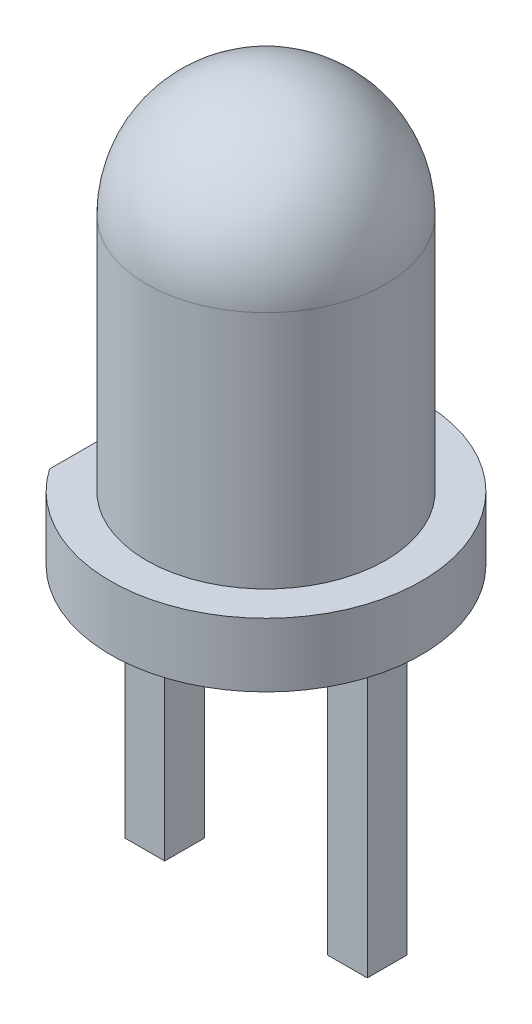
ISO-10303-21;
HEADER;
FILE_DESCRIPTION(('STEP AP214'),'2;1');
FILE_NAME('part.step','',(''),(''),'','','');
FILE_SCHEMA(('AUTOMOTIVE_DESIGN { 1 0 10303 214 1 1 1 1 }'));
ENDSEC;
DATA;
#1=APPLICATION_CONTEXT('core data for automotive mechanical design processes');
#2=APPLICATION_PROTOCOL_DEFINITION('international standard','automotive_design',2000,#1);
#3=PRODUCT_CONTEXT('',#1,'mechanical');
#4=PRODUCT('Part','Part','',(#3));
#5=PRODUCT_RELATED_PRODUCT_CATEGORY('part','',(#4));
#6=PRODUCT_DEFINITION_FORMATION('','',#4);
#7=PRODUCT_DEFINITION_CONTEXT('part definition',#1,'design');
#8=PRODUCT_DEFINITION('design','',#6,#7);
#9=PRODUCT_DEFINITION_SHAPE('','',#8);
#10=(LENGTH_UNIT() NAMED_UNIT(*) SI_UNIT(.MILLI.,.METRE.));
#11=(NAMED_UNIT(*) PLANE_ANGLE_UNIT() SI_UNIT($,.RADIAN.));
#12=(NAMED_UNIT(*) SI_UNIT($,.STERADIAN.) SOLID_ANGLE_UNIT());
#13=UNCERTAINTY_MEASURE_WITH_UNIT(LENGTH_MEASURE(1.E-05),#10,'distance_accuracy_value','');
#14=(GEOMETRIC_REPRESENTATION_CONTEXT(3) GLOBAL_UNCERTAINTY_ASSIGNED_CONTEXT((#13)) GLOBAL_UNIT_ASSIGNED_CONTEXT((#10,
#11,#12)) REPRESENTATION_CONTEXT('',''));
#15=CARTESIAN_POINT('',(0.,0.,0.));
#16=DIRECTION('',(0.,0.,1.));
#17=DIRECTION('',(1.,0.,0.));
#18=AXIS2_PLACEMENT_3D('',#15,#16,#17);
#19=CARTESIAN_POINT('',(0.,0.,0.));
#20=DIRECTION('',(0.,-1.,0.));
#21=DIRECTION('',(1.,0.,0.));
#22=AXIS2_PLACEMENT_3D('',#19,#20,#21);
#23=PLANE('',#22);
#24=DIRECTION('',(0.,0.,1.));
#25=VECTOR('',#24,1.);
#26=CARTESIAN_POINT('',(-1.6,0.,-2.));
#27=LINE('',#26,#25);
#28=CARTESIAN_POINT('',(-1.6,0.,-1.1146748404804));
#29=VERTEX_POINT('',#28);
#30=CARTESIAN_POINT('',(-1.6,0.,1.1146748404804));
#31=VERTEX_POINT('',#30);
#32=EDGE_CURVE('E119',#29,#31,#27,.T.);
#33=ORIENTED_EDGE('',*,*,#32,.F.);
#34=CARTESIAN_POINT('',(0.,0.,0.));
#35=DIRECTION('',(0.,1.,0.));
#36=DIRECTION('',(-1.,0.,0.));
#37=AXIS2_PLACEMENT_3D('',#34,#35,#36);
#38=CIRCLE('',#37,1.95);
#39=EDGE_CURVE('E49',#31,#29,#38,.T.);
#40=ORIENTED_EDGE('',*,*,#39,.F.);
#41=EDGE_LOOP('',(#33,#40));
#42=FACE_BOUND('',#41,.T.);
#43=DIRECTION('',(-1.,0.,0.));
#44=VECTOR('',#43,1.);
#45=CARTESIAN_POINT('',(-1.52,0.,0.25));
#46=LINE('',#45,#44);
#47=CARTESIAN_POINT('',(-1.02,0.,0.25));
#48=VERTEX_POINT('',#47);
#49=CARTESIAN_POINT('',(-1.52,0.,0.25));
#50=VERTEX_POINT('',#49);
#51=EDGE_CURVE('E169',#48,#50,#46,.T.);
#52=ORIENTED_EDGE('',*,*,#51,.F.);
#53=DIRECTION('',(0.,0.,1.));
#54=VECTOR('',#53,1.);
#55=CARTESIAN_POINT('',(-1.02,0.,-0.25));
#56=LINE('',#55,#54);
#57=CARTESIAN_POINT('',(-1.02,0.,-0.25));
#58=VERTEX_POINT('',#57);
#59=EDGE_CURVE('E172',#58,#48,#56,.T.);
#60=ORIENTED_EDGE('',*,*,#59,.F.);
#61=DIRECTION('',(1.,0.,0.));
#62=VECTOR('',#61,1.);
#63=CARTESIAN_POINT('',(-1.52,0.,-0.25));
#64=LINE('',#63,#62);
#65=CARTESIAN_POINT('',(-1.52,0.,-0.25));
#66=VERTEX_POINT('',#65);
#67=EDGE_CURVE('E161',#66,#58,#64,.T.);
#68=ORIENTED_EDGE('',*,*,#67,.F.);
#69=DIRECTION('',(0.,0.,-1.));
#70=VECTOR('',#69,1.);
#71=CARTESIAN_POINT('',(-1.52,0.,-0.25));
#72=LINE('',#71,#70);
#73=EDGE_CURVE('E165',#50,#66,#72,.T.);
#74=ORIENTED_EDGE('',*,*,#73,.F.);
#75=EDGE_LOOP('',(#52,#60,#68,#74));
#76=FACE_BOUND('',#75,.T.);
#77=DIRECTION('',(-1.,0.,0.));
#78=VECTOR('',#77,1.);
#79=CARTESIAN_POINT('',(1.02,0.,0.25));
#80=LINE('',#79,#78);
#81=CARTESIAN_POINT('',(1.52,0.,0.25));
#82=VERTEX_POINT('',#81);
#83=CARTESIAN_POINT('',(1.02,0.,0.25));
#84=VERTEX_POINT('',#83);
#85=EDGE_CURVE('E208',#82,#84,#80,.T.);
#86=ORIENTED_EDGE('',*,*,#85,.F.);
#87=DIRECTION('',(0.,0.,1.));
#88=VECTOR('',#87,1.);
#89=CARTESIAN_POINT('',(1.52,0.,-0.25));
#90=LINE('',#89,#88);
#91=CARTESIAN_POINT('',(1.52,0.,-0.25));
#92=VERTEX_POINT('',#91);
#93=EDGE_CURVE('E125',#92,#82,#90,.T.);
#94=ORIENTED_EDGE('',*,*,#93,.F.);
#95=DIRECTION('',(1.,0.,0.));
#96=VECTOR('',#95,1.);
#97=CARTESIAN_POINT('',(1.02,0.,-0.25));
#98=LINE('',#97,#96);
#99=CARTESIAN_POINT('',(1.02,0.,-0.25));
#100=VERTEX_POINT('',#99);
#101=EDGE_CURVE('E201',#100,#92,#98,.T.);
#102=ORIENTED_EDGE('',*,*,#101,.F.);
#103=DIRECTION('',(0.,0.,-1.));
#104=VECTOR('',#103,1.);
#105=CARTESIAN_POINT('',(1.02,0.,-0.25));
#106=LINE('',#105,#104);
#107=EDGE_CURVE('E205',#84,#100,#106,.T.);
#108=ORIENTED_EDGE('',*,*,#107,.F.);
#109=EDGE_LOOP('',(#86,#94,#102,#108));
#110=FACE_BOUND('',#109,.T.);
#111=ADVANCED_FACE('F41',(#42,#76,#110),#23,.T.);
#112=CARTESIAN_POINT('',(0.,5.3,0.));
#113=DIRECTION('',(0.,1.,0.));
#114=DIRECTION('',(-1.,0.,0.));
#115=AXIS2_PLACEMENT_3D('',#112,#113,#114);
#116=CYLINDRICAL_SURFACE('',#115,1.95);
#117=DIRECTION('',(0.,1.,0.));
#118=VECTOR('',#117,1.);
#119=CARTESIAN_POINT('',(-1.6,5.3,-1.1146748404804));
#120=LINE('',#119,#118);
#121=CARTESIAN_POINT('',(-1.6,0.8,-1.1146748404804));
#122=VERTEX_POINT('',#121);
#123=EDGE_CURVE('E116',#122,#29,#120,.F.);
#124=ORIENTED_EDGE('',*,*,#123,.F.);
#125=CARTESIAN_POINT('',(0.,0.799999999999999,0.));
#126=DIRECTION('',(0.,1.,0.));
#127=DIRECTION('',(-1.,0.,0.));
#128=AXIS2_PLACEMENT_3D('',#125,#126,#127);
#129=CIRCLE('',#128,1.95);
#130=CARTESIAN_POINT('',(-1.6,0.8,1.1146748404804));
#131=VERTEX_POINT('',#130);
#132=EDGE_CURVE('E134',#131,#122,#129,.T.);
#133=ORIENTED_EDGE('',*,*,#132,.F.);
#134=DIRECTION('',(0.,1.,0.));
#135=VECTOR('',#134,1.);
#136=CARTESIAN_POINT('',(-1.6,5.3,1.1146748404804));
#137=LINE('',#136,#135);
#138=EDGE_CURVE('E55',#31,#131,#137,.T.);
#139=ORIENTED_EDGE('',*,*,#138,.F.);
#140=ORIENTED_EDGE('',*,*,#39,.T.);
#141=EDGE_LOOP('',(#124,#133,#139,#140));
#142=FACE_BOUND('',#141,.T.);
#143=ADVANCED_FACE('F132',(#142),#116,.T.);
#144=CARTESIAN_POINT('',(-1.95,0.8,0.));
#145=DIRECTION('',(0.,1.,0.));
#146=DIRECTION('',(-1.,0.,0.));
#147=AXIS2_PLACEMENT_3D('',#144,#145,#146);
#148=PLANE('',#147);
#149=DIRECTION('',(0.,0.,-1.));
#150=VECTOR('',#149,1.);
#151=CARTESIAN_POINT('',(-1.6,0.8,0.));
#152=LINE('',#151,#150);
#153=EDGE_CURVE('E11',#131,#122,#152,.T.);
#154=ORIENTED_EDGE('',*,*,#153,.F.);
#155=ORIENTED_EDGE('',*,*,#132,.T.);
#156=EDGE_LOOP('',(#154,#155));
#157=FACE_BOUND('',#156,.T.);
#158=CARTESIAN_POINT('',(0.,0.799999999999999,0.));
#159=DIRECTION('',(0.,1.,0.));
#160=DIRECTION('',(-1.,0.,0.));
#161=AXIS2_PLACEMENT_3D('',#158,#159,#160);
#162=CIRCLE('',#161,1.5);
#163=CARTESIAN_POINT('',(-1.5,0.8,0.));
#164=VERTEX_POINT('',#163);
#165=EDGE_CURVE('E136',#164,#164,#162,.T.);
#166=ORIENTED_EDGE('',*,*,#165,.F.);
#167=EDGE_LOOP('',(#166));
#168=FACE_BOUND('',#167,.T.);
#169=ADVANCED_FACE('F249',(#157,#168),#148,.T.);
#170=CARTESIAN_POINT('',(0.,5.3,0.));
#171=DIRECTION('',(0.,1.,0.));
#172=DIRECTION('',(-1.,0.,0.));
#173=AXIS2_PLACEMENT_3D('',#170,#171,#172);
#174=CYLINDRICAL_SURFACE('',#173,1.5);
#175=ORIENTED_EDGE('',*,*,#165,.T.);
#176=EDGE_LOOP('',(#175));
#177=FACE_BOUND('',#176,.T.);
#178=CARTESIAN_POINT('',(0.,3.8,0.));
#179=DIRECTION('',(0.,1.,0.));
#180=DIRECTION('',(-1.,0.,0.));
#181=AXIS2_PLACEMENT_3D('',#178,#179,#180);
#182=CIRCLE('',#181,1.5);
#183=CARTESIAN_POINT('',(-1.5,3.8,0.));
#184=VERTEX_POINT('',#183);
#185=EDGE_CURVE('E142',#184,#184,#182,.T.);
#186=ORIENTED_EDGE('',*,*,#185,.F.);
#187=EDGE_LOOP('',(#186));
#188=FACE_BOUND('',#187,.T.);
#189=ADVANCED_FACE('F253',(#177,#188),#174,.T.);
#190=CARTESIAN_POINT('',(0.,3.8,0.));
#191=DIRECTION('',(0.,1.,0.));
#192=DIRECTION('',(1.,0.,0.));
#193=AXIS2_PLACEMENT_3D('',#190,#191,#192);
#194=SPHERICAL_SURFACE('',#193,1.5);
#195=ORIENTED_EDGE('',*,*,#185,.T.);
#196=EDGE_LOOP('',(#195));
#197=FACE_BOUND('',#196,.T.);
#198=ADVANCED_FACE('F259',(#197),#194,.T.);
#199=CARTESIAN_POINT('',(-1.02,-3.6,-0.25));
#200=DIRECTION('',(-1.,0.,0.));
#201=DIRECTION('',(0.,-1.,0.));
#202=AXIS2_PLACEMENT_3D('',#199,#200,#201);
#203=PLANE('',#202);
#204=ORIENTED_EDGE('',*,*,#59,.T.);
#205=DIRECTION('',(0.,1.,0.));
#206=VECTOR('',#205,1.);
#207=CARTESIAN_POINT('',(-1.02,-3.6,0.25));
#208=LINE('',#207,#206);
#209=CARTESIAN_POINT('',(-1.02,-3.6,0.25));
#210=VERTEX_POINT('',#209);
#211=EDGE_CURVE('E146',#210,#48,#208,.T.);
#212=ORIENTED_EDGE('',*,*,#211,.F.);
#213=DIRECTION('',(0.,0.,1.));
#214=VECTOR('',#213,1.);
#215=CARTESIAN_POINT('',(-1.02,-3.6,-0.25));
#216=LINE('',#215,#214);
#217=CARTESIAN_POINT('',(-1.02,-3.6,-0.25));
#218=VERTEX_POINT('',#217);
#219=EDGE_CURVE('E164',#218,#210,#216,.T.);
#220=ORIENTED_EDGE('',*,*,#219,.F.);
#221=DIRECTION('',(0.,1.,0.));
#222=VECTOR('',#221,1.);
#223=CARTESIAN_POINT('',(-1.02,-3.6,-0.25));
#224=LINE('',#223,#222);
#225=EDGE_CURVE('E156',#218,#58,#224,.T.);
#226=ORIENTED_EDGE('',*,*,#225,.T.);
#227=EDGE_LOOP('',(#204,#212,#220,#226));
#228=FACE_BOUND('',#227,.T.);
#229=ADVANCED_FACE('F263',(#228),#203,.F.);
#230=CARTESIAN_POINT('',(-1.52,-3.6,0.25));
#231=DIRECTION('',(0.,0.,-1.));
#232=DIRECTION('',(-1.,0.,0.));
#233=AXIS2_PLACEMENT_3D('',#230,#231,#232);
#234=PLANE('',#233);
#235=ORIENTED_EDGE('',*,*,#51,.T.);
#236=DIRECTION('',(0.,1.,0.));
#237=VECTOR('',#236,1.);
#238=CARTESIAN_POINT('',(-1.52,-3.6,0.25));
#239=LINE('',#238,#237);
#240=CARTESIAN_POINT('',(-1.52,-3.6,0.25));
#241=VERTEX_POINT('',#240);
#242=EDGE_CURVE('E149',#241,#50,#239,.T.);
#243=ORIENTED_EDGE('',*,*,#242,.F.);
#244=DIRECTION('',(-1.,0.,0.));
#245=VECTOR('',#244,1.);
#246=CARTESIAN_POINT('',(-1.52,-3.6,0.25));
#247=LINE('',#246,#245);
#248=EDGE_CURVE('E182',#210,#241,#247,.T.);
#249=ORIENTED_EDGE('',*,*,#248,.F.);
#250=ORIENTED_EDGE('',*,*,#211,.T.);
#251=EDGE_LOOP('',(#235,#243,#249,#250));
#252=FACE_BOUND('',#251,.T.);
#253=ADVANCED_FACE('F267',(#252),#234,.F.);
#254=CARTESIAN_POINT('',(-1.52,-3.6,-0.25));
#255=DIRECTION('',(1.,0.,0.));
#256=DIRECTION('',(0.,1.,0.));
#257=AXIS2_PLACEMENT_3D('',#254,#255,#256);
#258=PLANE('',#257);
#259=ORIENTED_EDGE('',*,*,#73,.T.);
#260=DIRECTION('',(0.,1.,0.));
#261=VECTOR('',#260,1.);
#262=CARTESIAN_POINT('',(-1.52,-3.6,-0.25));
#263=LINE('',#262,#261);
#264=CARTESIAN_POINT('',(-1.52,-3.6,-0.25));
#265=VERTEX_POINT('',#264);
#266=EDGE_CURVE('E153',#265,#66,#263,.T.);
#267=ORIENTED_EDGE('',*,*,#266,.F.);
#268=DIRECTION('',(0.,0.,-1.));
#269=VECTOR('',#268,1.);
#270=CARTESIAN_POINT('',(-1.52,-3.6,-0.25));
#271=LINE('',#270,#269);
#272=EDGE_CURVE('E179',#241,#265,#271,.T.);
#273=ORIENTED_EDGE('',*,*,#272,.F.);
#274=ORIENTED_EDGE('',*,*,#242,.T.);
#275=EDGE_LOOP('',(#259,#267,#273,#274));
#276=FACE_BOUND('',#275,.T.);
#277=ADVANCED_FACE('F271',(#276),#258,.F.);
#278=CARTESIAN_POINT('',(-1.52,-3.6,-0.25));
#279=DIRECTION('',(0.,0.,1.));
#280=DIRECTION('',(1.,0.,0.));
#281=AXIS2_PLACEMENT_3D('',#278,#279,#280);
#282=PLANE('',#281);
#283=ORIENTED_EDGE('',*,*,#67,.T.);
#284=ORIENTED_EDGE('',*,*,#225,.F.);
#285=DIRECTION('',(1.,0.,0.));
#286=VECTOR('',#285,1.);
#287=CARTESIAN_POINT('',(-1.52,-3.6,-0.25));
#288=LINE('',#287,#286);
#289=EDGE_CURVE('E160',#265,#218,#288,.T.);
#290=ORIENTED_EDGE('',*,*,#289,.F.);
#291=ORIENTED_EDGE('',*,*,#266,.T.);
#292=EDGE_LOOP('',(#283,#284,#290,#291));
#293=FACE_BOUND('',#292,.T.);
#294=ADVANCED_FACE('F275',(#293),#282,.F.);
#295=CARTESIAN_POINT('',(0.,-3.6,0.));
#296=DIRECTION('',(0.,1.,0.));
#297=DIRECTION('',(-1.,0.,0.));
#298=AXIS2_PLACEMENT_3D('',#295,#296,#297);
#299=PLANE('',#298);
#300=ORIENTED_EDGE('',*,*,#219,.T.);
#301=ORIENTED_EDGE('',*,*,#248,.T.);
#302=ORIENTED_EDGE('',*,*,#272,.T.);
#303=ORIENTED_EDGE('',*,*,#289,.T.);
#304=EDGE_LOOP('',(#300,#301,#302,#303));
#305=FACE_BOUND('',#304,.T.);
#306=ADVANCED_FACE('F279',(#305),#299,.F.);
#307=CARTESIAN_POINT('',(1.52,-3.6,-0.25));
#308=DIRECTION('',(-1.,0.,0.));
#309=DIRECTION('',(0.,-1.,0.));
#310=AXIS2_PLACEMENT_3D('',#307,#308,#309);
#311=PLANE('',#310);
#312=ORIENTED_EDGE('',*,*,#93,.T.);
#313=DIRECTION('',(0.,1.,0.));
#314=VECTOR('',#313,1.);
#315=CARTESIAN_POINT('',(1.52,-3.6,0.25));
#316=LINE('',#315,#314);
#317=CARTESIAN_POINT('',(1.52,-3.6,0.25));
#318=VERTEX_POINT('',#317);
#319=EDGE_CURVE('E176',#318,#82,#316,.T.);
#320=ORIENTED_EDGE('',*,*,#319,.F.);
#321=DIRECTION('',(0.,0.,1.));
#322=VECTOR('',#321,1.);
#323=CARTESIAN_POINT('',(1.52,-3.6,-0.25));
#324=LINE('',#323,#322);
#325=CARTESIAN_POINT('',(1.52,-3.6,-0.25));
#326=VERTEX_POINT('',#325);
#327=EDGE_CURVE('E204',#326,#318,#324,.T.);
#328=ORIENTED_EDGE('',*,*,#327,.F.);
#329=DIRECTION('',(0.,1.,0.));
#330=VECTOR('',#329,1.);
#331=CARTESIAN_POINT('',(1.52,-3.6,-0.25));
#332=LINE('',#331,#330);
#333=EDGE_CURVE('E196',#326,#92,#332,.T.);
#334=ORIENTED_EDGE('',*,*,#333,.T.);
#335=EDGE_LOOP('',(#312,#320,#328,#334));
#336=FACE_BOUND('',#335,.T.);
#337=ADVANCED_FACE('F233',(#336),#311,.F.);
#338=CARTESIAN_POINT('',(1.02,-3.6,0.25));
#339=DIRECTION('',(0.,0.,-1.));
#340=DIRECTION('',(-1.,0.,0.));
#341=AXIS2_PLACEMENT_3D('',#338,#339,#340);
#342=PLANE('',#341);
#343=ORIENTED_EDGE('',*,*,#85,.T.);
#344=DIRECTION('',(0.,1.,0.));
#345=VECTOR('',#344,1.);
#346=CARTESIAN_POINT('',(1.02,-3.6,0.25));
#347=LINE('',#346,#345);
#348=CARTESIAN_POINT('',(1.02,-3.6,0.25));
#349=VERTEX_POINT('',#348);
#350=EDGE_CURVE('E190',#349,#84,#347,.T.);
#351=ORIENTED_EDGE('',*,*,#350,.F.);
#352=DIRECTION('',(-1.,0.,0.));
#353=VECTOR('',#352,1.);
#354=CARTESIAN_POINT('',(1.02,-3.6,0.25));
#355=LINE('',#354,#353);
#356=EDGE_CURVE('E219',#318,#349,#355,.T.);
#357=ORIENTED_EDGE('',*,*,#356,.F.);
#358=ORIENTED_EDGE('',*,*,#319,.T.);
#359=EDGE_LOOP('',(#343,#351,#357,#358));
#360=FACE_BOUND('',#359,.T.);
#361=ADVANCED_FACE('F237',(#360),#342,.F.);
#362=CARTESIAN_POINT('',(1.02,-3.6,-0.25));
#363=DIRECTION('',(1.,0.,0.));
#364=DIRECTION('',(0.,1.,0.));
#365=AXIS2_PLACEMENT_3D('',#362,#363,#364);
#366=PLANE('',#365);
#367=ORIENTED_EDGE('',*,*,#107,.T.);
#368=DIRECTION('',(0.,1.,0.));
#369=VECTOR('',#368,1.);
#370=CARTESIAN_POINT('',(1.02,-3.6,-0.25));
#371=LINE('',#370,#369);
#372=CARTESIAN_POINT('',(1.02,-3.6,-0.25));
#373=VERTEX_POINT('',#372);
#374=EDGE_CURVE('E63',#373,#100,#371,.T.);
#375=ORIENTED_EDGE('',*,*,#374,.F.);
#376=DIRECTION('',(0.,0.,-1.));
#377=VECTOR('',#376,1.);
#378=CARTESIAN_POINT('',(1.02,-3.6,-0.25));
#379=LINE('',#378,#377);
#380=EDGE_CURVE('E216',#349,#373,#379,.T.);
#381=ORIENTED_EDGE('',*,*,#380,.F.);
#382=ORIENTED_EDGE('',*,*,#350,.T.);
#383=EDGE_LOOP('',(#367,#375,#381,#382));
#384=FACE_BOUND('',#383,.T.);
#385=ADVANCED_FACE('F241',(#384),#366,.F.);
#386=CARTESIAN_POINT('',(1.02,-3.6,-0.25));
#387=DIRECTION('',(0.,0.,1.));
#388=DIRECTION('',(1.,0.,0.));
#389=AXIS2_PLACEMENT_3D('',#386,#387,#388);
#390=PLANE('',#389);
#391=ORIENTED_EDGE('',*,*,#101,.T.);
#392=ORIENTED_EDGE('',*,*,#333,.F.);
#393=DIRECTION('',(1.,0.,0.));
#394=VECTOR('',#393,1.);
#395=CARTESIAN_POINT('',(1.02,-3.6,-0.25));
#396=LINE('',#395,#394);
#397=EDGE_CURVE('E200',#373,#326,#396,.T.);
#398=ORIENTED_EDGE('',*,*,#397,.F.);
#399=ORIENTED_EDGE('',*,*,#374,.T.);
#400=EDGE_LOOP('',(#391,#392,#398,#399));
#401=FACE_BOUND('',#400,.T.);
#402=ADVANCED_FACE('F243',(#401),#390,.F.);
#403=CARTESIAN_POINT('',(0.,-3.6,0.));
#404=DIRECTION('',(0.,1.,0.));
#405=DIRECTION('',(-1.,0.,0.));
#406=AXIS2_PLACEMENT_3D('',#403,#404,#405);
#407=PLANE('',#406);
#408=ORIENTED_EDGE('',*,*,#327,.T.);
#409=ORIENTED_EDGE('',*,*,#356,.T.);
#410=ORIENTED_EDGE('',*,*,#380,.T.);
#411=ORIENTED_EDGE('',*,*,#397,.T.);
#412=EDGE_LOOP('',(#408,#409,#410,#411));
#413=FACE_BOUND('',#412,.T.);
#414=ADVANCED_FACE('F229',(#413),#407,.F.);
#415=CARTESIAN_POINT('',(-1.6,5.3,-2.));
#416=DIRECTION('',(1.,0.,0.));
#417=DIRECTION('',(0.,1.,0.));
#418=AXIS2_PLACEMENT_3D('',#415,#416,#417);
#419=PLANE('',#418);
#420=ORIENTED_EDGE('',*,*,#123,.T.);
#421=ORIENTED_EDGE('',*,*,#32,.T.);
#422=ORIENTED_EDGE('',*,*,#138,.T.);
#423=ORIENTED_EDGE('',*,*,#153,.T.);
#424=EDGE_LOOP('',(#420,#421,#422,#423));
#425=FACE_BOUND('',#424,.T.);
#426=ADVANCED_FACE('F118',(#425),#419,.F.);
#427=CLOSED_SHELL('',(#111,#143,#169,#189,#198,#229,#253,#277,#294,#306,#337,#361,#385,#402,
#414,#426));
#428=MANIFOLD_SOLID_BREP('B2',#427);
#429=ADVANCED_BREP_SHAPE_REPRESENTATION('',(#18,#428),#14);
#430=SHAPE_DEFINITION_REPRESENTATION(#9,#429);
ENDSEC;
END-ISO-10303-21;
